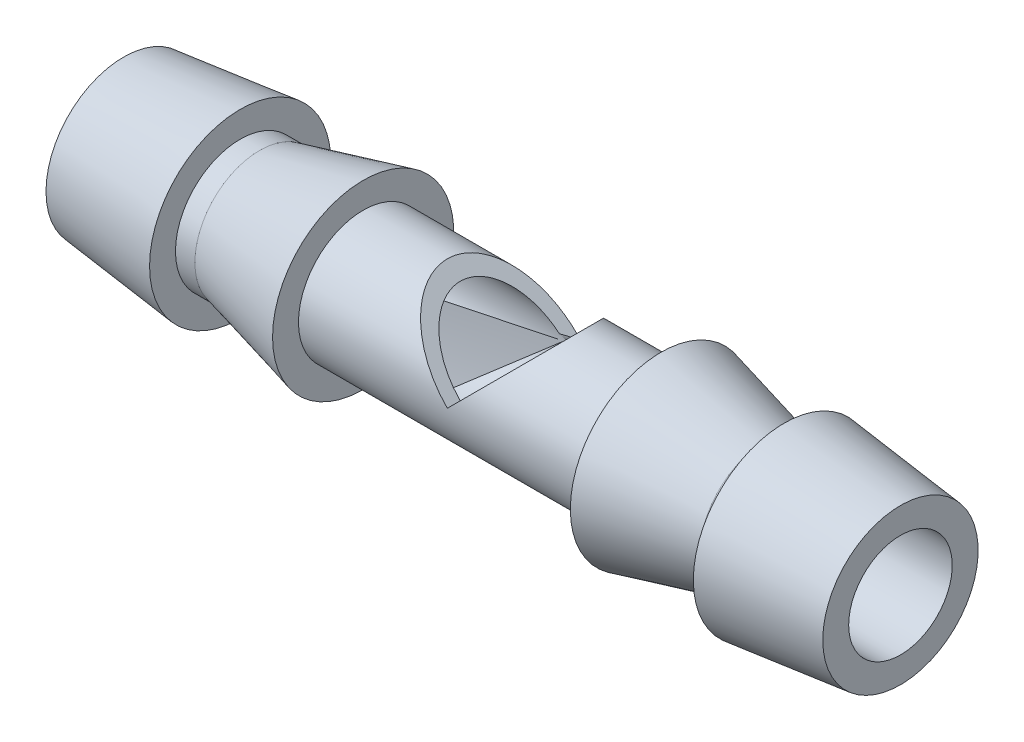
ISO-10303-21;
HEADER;
FILE_DESCRIPTION(('STEP AP214'),'2;1');
FILE_NAME('part.step','',(''),(''),'','','');
FILE_SCHEMA(('AUTOMOTIVE_DESIGN { 1 0 10303 214 1 1 1 1 }'));
ENDSEC;
DATA;
#1=APPLICATION_CONTEXT('core data for automotive mechanical design processes');
#2=APPLICATION_PROTOCOL_DEFINITION('international standard','automotive_design',2000,#1);
#3=PRODUCT_CONTEXT('',#1,'mechanical');
#4=PRODUCT('Part','Part','',(#3));
#5=PRODUCT_RELATED_PRODUCT_CATEGORY('part','',(#4));
#6=PRODUCT_DEFINITION_FORMATION('','',#4);
#7=PRODUCT_DEFINITION_CONTEXT('part definition',#1,'design');
#8=PRODUCT_DEFINITION('design','',#6,#7);
#9=PRODUCT_DEFINITION_SHAPE('','',#8);
#10=(LENGTH_UNIT() NAMED_UNIT(*) SI_UNIT(.MILLI.,.METRE.));
#11=(NAMED_UNIT(*) PLANE_ANGLE_UNIT() SI_UNIT($,.RADIAN.));
#12=(NAMED_UNIT(*) SI_UNIT($,.STERADIAN.) SOLID_ANGLE_UNIT());
#13=UNCERTAINTY_MEASURE_WITH_UNIT(LENGTH_MEASURE(1.E-05),#10,'distance_accuracy_value','');
#14=(GEOMETRIC_REPRESENTATION_CONTEXT(3) GLOBAL_UNCERTAINTY_ASSIGNED_CONTEXT((#13)) GLOBAL_UNIT_ASSIGNED_CONTEXT((#10,
#11,#12)) REPRESENTATION_CONTEXT('',''));
#15=CARTESIAN_POINT('',(0.,0.,0.));
#16=DIRECTION('',(0.,0.,1.));
#17=DIRECTION('',(1.,0.,0.));
#18=AXIS2_PLACEMENT_3D('',#15,#16,#17);
#19=CARTESIAN_POINT('',(-19.363000869984,2.,0.));
#20=DIRECTION('',(-1.,0.,0.));
#21=DIRECTION('',(0.,0.,1.));
#22=AXIS2_PLACEMENT_3D('',#19,#20,#21);
#23=PLANE('',#22);
#24=CARTESIAN_POINT('',(-19.363000869984,0.,0.));
#25=DIRECTION('',(-1.,0.,0.));
#26=DIRECTION('',(0.,0.,1.));
#27=AXIS2_PLACEMENT_3D('',#24,#25,#26);
#28=CIRCLE('',#27,3.);
#29=CARTESIAN_POINT('',(-19.363000869984,0.,3.));
#30=VERTEX_POINT('',#29);
#31=EDGE_CURVE('E89',#30,#30,#28,.T.);
#32=ORIENTED_EDGE('',*,*,#31,.F.);
#33=EDGE_LOOP('',(#32));
#34=FACE_BOUND('',#33,.T.);
#35=CARTESIAN_POINT('',(-19.363000869984,0.,0.));
#36=DIRECTION('',(-1.,0.,0.));
#37=DIRECTION('',(0.,0.,1.));
#38=AXIS2_PLACEMENT_3D('',#35,#36,#37);
#39=CIRCLE('',#38,2.);
#40=CARTESIAN_POINT('',(-19.363000869984,0.,2.));
#41=VERTEX_POINT('',#40);
#42=EDGE_CURVE('E76',#41,#41,#39,.T.);
#43=ORIENTED_EDGE('',*,*,#42,.T.);
#44=EDGE_LOOP('',(#43));
#45=FACE_BOUND('',#44,.T.);
#46=ADVANCED_FACE('F43',(#34,#45),#23,.F.);
#47=CARTESIAN_POINT('',(0.,0.,0.));
#48=DIRECTION('',(-1.,0.,0.));
#49=DIRECTION('',(0.,0.,1.));
#50=AXIS2_PLACEMENT_3D('',#47,#48,#49);
#51=CYLINDRICAL_SURFACE('',#50,2.);
#52=CARTESIAN_POINT('',(-34.363000869984,0.,0.));
#53=DIRECTION('',(-0.707106781186543,-0.707106781186552,0.));
#54=DIRECTION('',(-0.707106781186552,0.707106781186543,0.));
#55=AXIS2_PLACEMENT_3D('',#52,#53,#54);
#56=ELLIPSE('',#55,2.82842712474621,2.);
#57=CARTESIAN_POINT('',(-34.363000869984,0.,-2.));
#58=VERTEX_POINT('',#57);
#59=CARTESIAN_POINT('',(-34.363000869984,0.,2.));
#60=VERTEX_POINT('',#59);
#61=EDGE_CURVE('E79',#58,#60,#56,.F.);
#62=ORIENTED_EDGE('',*,*,#61,.T.);
#63=CARTESIAN_POINT('',(-34.363000869984,0.,0.));
#64=DIRECTION('',(0.707106781186548,-0.707106781186547,0.));
#65=DIRECTION('',(-0.707106781186547,-0.707106781186548,0.));
#66=AXIS2_PLACEMENT_3D('',#63,#64,#65);
#67=ELLIPSE('',#66,2.82842712474619,2.);
#68=EDGE_CURVE('E84',#60,#58,#67,.F.);
#69=ORIENTED_EDGE('',*,*,#68,.T.);
#70=EDGE_LOOP('',(#62,#69));
#71=FACE_BOUND('',#70,.T.);
#72=ORIENTED_EDGE('',*,*,#42,.F.);
#73=EDGE_LOOP('',(#72));
#74=FACE_BOUND('',#73,.T.);
#75=CARTESIAN_POINT('',(-49.363000869984,0.,0.));
#76=DIRECTION('',(-1.,0.,0.));
#77=DIRECTION('',(0.,0.,1.));
#78=AXIS2_PLACEMENT_3D('',#75,#76,#77);
#79=CIRCLE('',#78,2.);
#80=CARTESIAN_POINT('',(-49.363000869984,0.,2.));
#81=VERTEX_POINT('',#80);
#82=EDGE_CURVE('E137',#81,#81,#79,.T.);
#83=ORIENTED_EDGE('',*,*,#82,.T.);
#84=EDGE_LOOP('',(#83));
#85=FACE_BOUND('',#84,.T.);
#86=ADVANCED_FACE('F146',(#71,#74,#85),#51,.F.);
#87=CARTESIAN_POINT('',(-49.363000869984,2.,0.));
#88=DIRECTION('',(1.,0.,0.));
#89=DIRECTION('',(0.,0.,-1.));
#90=AXIS2_PLACEMENT_3D('',#87,#88,#89);
#91=PLANE('',#90);
#92=ORIENTED_EDGE('',*,*,#82,.F.);
#93=EDGE_LOOP('',(#92));
#94=FACE_BOUND('',#93,.T.);
#95=CARTESIAN_POINT('',(-49.363000869984,0.,0.));
#96=DIRECTION('',(-1.,0.,0.));
#97=DIRECTION('',(0.,0.,1.));
#98=AXIS2_PLACEMENT_3D('',#95,#96,#97);
#99=CIRCLE('',#98,3.);
#100=CARTESIAN_POINT('',(-49.363000869984,0.,3.));
#101=VERTEX_POINT('',#100);
#102=EDGE_CURVE('E133',#101,#101,#99,.T.);
#103=ORIENTED_EDGE('',*,*,#102,.T.);
#104=EDGE_LOOP('',(#103));
#105=FACE_BOUND('',#104,.T.);
#106=ADVANCED_FACE('F149',(#94,#105),#91,.F.);
#107=CARTESIAN_POINT('',(-44.863000869984,0.,0.));
#108=DIRECTION('',(1.,0.,0.));
#109=DIRECTION('',(0.,0.,-1.));
#110=AXIS2_PLACEMENT_3D('',#107,#108,#109);
#111=CONICAL_SURFACE('',#110,3.5,0.110657221173896);
#112=ORIENTED_EDGE('',*,*,#102,.F.);
#113=EDGE_LOOP('',(#112));
#114=FACE_BOUND('',#113,.T.);
#115=CARTESIAN_POINT('',(-44.863000869984,0.,0.));
#116=DIRECTION('',(-1.,0.,0.));
#117=DIRECTION('',(0.,0.,1.));
#118=AXIS2_PLACEMENT_3D('',#115,#116,#117);
#119=CIRCLE('',#118,3.5);
#120=CARTESIAN_POINT('',(-44.863000869984,0.,3.5));
#121=VERTEX_POINT('',#120);
#122=EDGE_CURVE('E129',#121,#121,#119,.T.);
#123=ORIENTED_EDGE('',*,*,#122,.T.);
#124=EDGE_LOOP('',(#123));
#125=FACE_BOUND('',#124,.T.);
#126=ADVANCED_FACE('F155',(#114,#125),#111,.T.);
#127=CARTESIAN_POINT('',(-44.863000869984,3.5,0.));
#128=DIRECTION('',(-1.,0.,0.));
#129=DIRECTION('',(0.,0.,1.));
#130=AXIS2_PLACEMENT_3D('',#127,#128,#129);
#131=PLANE('',#130);
#132=ORIENTED_EDGE('',*,*,#122,.F.);
#133=EDGE_LOOP('',(#132));
#134=FACE_BOUND('',#133,.T.);
#135=CARTESIAN_POINT('',(-44.863000869984,0.,0.));
#136=DIRECTION('',(-1.,0.,0.));
#137=DIRECTION('',(0.,0.,1.));
#138=AXIS2_PLACEMENT_3D('',#135,#136,#137);
#139=CIRCLE('',#138,2.5);
#140=CARTESIAN_POINT('',(-44.863000869984,0.,2.5));
#141=VERTEX_POINT('',#140);
#142=EDGE_CURVE('E125',#141,#141,#139,.T.);
#143=ORIENTED_EDGE('',*,*,#142,.T.);
#144=EDGE_LOOP('',(#143));
#145=FACE_BOUND('',#144,.T.);
#146=ADVANCED_FACE('F161',(#134,#145),#131,.F.);
#147=CARTESIAN_POINT('',(0.,0.,0.));
#148=DIRECTION('',(-1.,0.,0.));
#149=DIRECTION('',(0.,0.,1.));
#150=AXIS2_PLACEMENT_3D('',#147,#148,#149);
#151=CYLINDRICAL_SURFACE('',#150,2.5);
#152=ORIENTED_EDGE('',*,*,#142,.F.);
#153=EDGE_LOOP('',(#152));
#154=FACE_BOUND('',#153,.T.);
#155=CARTESIAN_POINT('',(-44.113000869984,0.,0.));
#156=DIRECTION('',(-1.,0.,0.));
#157=DIRECTION('',(0.,0.,1.));
#158=AXIS2_PLACEMENT_3D('',#155,#156,#157);
#159=CIRCLE('',#158,2.5);
#160=CARTESIAN_POINT('',(-44.113000869984,0.,2.5));
#161=VERTEX_POINT('',#160);
#162=EDGE_CURVE('E121',#161,#161,#159,.T.);
#163=ORIENTED_EDGE('',*,*,#162,.T.);
#164=EDGE_LOOP('',(#163));
#165=FACE_BOUND('',#164,.T.);
#166=ADVANCED_FACE('F167',(#154,#165),#151,.T.);
#167=CARTESIAN_POINT('',(-40.113000869984,0.,0.));
#168=DIRECTION('',(1.,0.,0.));
#169=DIRECTION('',(0.,0.,-1.));
#170=AXIS2_PLACEMENT_3D('',#167,#168,#169);
#171=CONICAL_SURFACE('',#170,3.5,0.244978663126864);
#172=ORIENTED_EDGE('',*,*,#162,.F.);
#173=EDGE_LOOP('',(#172));
#174=FACE_BOUND('',#173,.T.);
#175=CARTESIAN_POINT('',(-40.113000869984,0.,0.));
#176=DIRECTION('',(-1.,0.,0.));
#177=DIRECTION('',(0.,0.,1.));
#178=AXIS2_PLACEMENT_3D('',#175,#176,#177);
#179=CIRCLE('',#178,3.5);
#180=CARTESIAN_POINT('',(-40.113000869984,0.,3.5));
#181=VERTEX_POINT('',#180);
#182=EDGE_CURVE('E117',#181,#181,#179,.T.);
#183=ORIENTED_EDGE('',*,*,#182,.T.);
#184=EDGE_LOOP('',(#183));
#185=FACE_BOUND('',#184,.T.);
#186=ADVANCED_FACE('F173',(#174,#185),#171,.T.);
#187=CARTESIAN_POINT('',(-40.113000869984,3.5,0.));
#188=DIRECTION('',(-1.,0.,0.));
#189=DIRECTION('',(0.,0.,1.));
#190=AXIS2_PLACEMENT_3D('',#187,#188,#189);
#191=PLANE('',#190);
#192=ORIENTED_EDGE('',*,*,#182,.F.);
#193=EDGE_LOOP('',(#192));
#194=FACE_BOUND('',#193,.T.);
#195=CARTESIAN_POINT('',(-40.113000869984,0.,0.));
#196=DIRECTION('',(-1.,0.,0.));
#197=DIRECTION('',(0.,0.,1.));
#198=AXIS2_PLACEMENT_3D('',#195,#196,#197);
#199=CIRCLE('',#198,2.5);
#200=CARTESIAN_POINT('',(-40.113000869984,0.,2.5));
#201=VERTEX_POINT('',#200);
#202=EDGE_CURVE('E113',#201,#201,#199,.T.);
#203=ORIENTED_EDGE('',*,*,#202,.T.);
#204=EDGE_LOOP('',(#203));
#205=FACE_BOUND('',#204,.T.);
#206=ADVANCED_FACE('F179',(#194,#205),#191,.F.);
#207=CARTESIAN_POINT('',(0.,0.,0.));
#208=DIRECTION('',(-1.,0.,0.));
#209=DIRECTION('',(0.,0.,1.));
#210=AXIS2_PLACEMENT_3D('',#207,#208,#209);
#211=CYLINDRICAL_SURFACE('',#210,2.5);
#212=CARTESIAN_POINT('',(-34.363000869984,0.,0.));
#213=DIRECTION('',(-0.707106781186543,-0.707106781186552,0.));
#214=DIRECTION('',(-0.707106781186552,0.707106781186543,0.));
#215=AXIS2_PLACEMENT_3D('',#212,#213,#214);
#216=ELLIPSE('',#215,3.53553390593276,2.5);
#217=CARTESIAN_POINT('',(-34.363000869984,0.,2.5));
#218=VERTEX_POINT('',#217);
#219=CARTESIAN_POINT('',(-34.363000869984,0.,-2.5));
#220=VERTEX_POINT('',#219);
#221=EDGE_CURVE('E51',#218,#220,#216,.T.);
#222=ORIENTED_EDGE('',*,*,#221,.T.);
#223=CARTESIAN_POINT('',(-34.363000869984,0.,0.));
#224=DIRECTION('',(0.707106781186548,-0.707106781186547,0.));
#225=DIRECTION('',(-0.707106781186547,-0.707106781186548,0.));
#226=AXIS2_PLACEMENT_3D('',#223,#224,#225);
#227=ELLIPSE('',#226,3.53553390593273,2.5);
#228=EDGE_CURVE('E11',#220,#218,#227,.T.);
#229=ORIENTED_EDGE('',*,*,#228,.T.);
#230=EDGE_LOOP('',(#222,#229));
#231=FACE_BOUND('',#230,.T.);
#232=ORIENTED_EDGE('',*,*,#202,.F.);
#233=EDGE_LOOP('',(#232));
#234=FACE_BOUND('',#233,.T.);
#235=CARTESIAN_POINT('',(-28.613000869984,0.,0.));
#236=DIRECTION('',(-1.,0.,0.));
#237=DIRECTION('',(0.,0.,1.));
#238=AXIS2_PLACEMENT_3D('',#235,#236,#237);
#239=CIRCLE('',#238,2.5);
#240=CARTESIAN_POINT('',(-28.613000869984,0.,2.5));
#241=VERTEX_POINT('',#240);
#242=EDGE_CURVE('E109',#241,#241,#239,.T.);
#243=ORIENTED_EDGE('',*,*,#242,.T.);
#244=EDGE_LOOP('',(#243));
#245=FACE_BOUND('',#244,.T.);
#246=ADVANCED_FACE('F73',(#231,#234,#245),#211,.T.);
#247=CARTESIAN_POINT('',(-28.613000869984,3.5,0.));
#248=DIRECTION('',(1.,0.,0.));
#249=DIRECTION('',(0.,0.,-1.));
#250=AXIS2_PLACEMENT_3D('',#247,#248,#249);
#251=PLANE('',#250);
#252=ORIENTED_EDGE('',*,*,#242,.F.);
#253=EDGE_LOOP('',(#252));
#254=FACE_BOUND('',#253,.T.);
#255=CARTESIAN_POINT('',(-28.613000869984,0.,0.));
#256=DIRECTION('',(-1.,0.,0.));
#257=DIRECTION('',(0.,0.,1.));
#258=AXIS2_PLACEMENT_3D('',#255,#256,#257);
#259=CIRCLE('',#258,3.5);
#260=CARTESIAN_POINT('',(-28.613000869984,0.,3.5));
#261=VERTEX_POINT('',#260);
#262=EDGE_CURVE('E105',#261,#261,#259,.T.);
#263=ORIENTED_EDGE('',*,*,#262,.T.);
#264=EDGE_LOOP('',(#263));
#265=FACE_BOUND('',#264,.T.);
#266=ADVANCED_FACE('F189',(#254,#265),#251,.F.);
#267=CARTESIAN_POINT('',(-24.613000869984,0.,0.));
#268=DIRECTION('',(-1.,0.,0.));
#269=DIRECTION('',(0.,0.,1.));
#270=AXIS2_PLACEMENT_3D('',#267,#268,#269);
#271=CONICAL_SURFACE('',#270,2.5,0.244978663126865);
#272=ORIENTED_EDGE('',*,*,#262,.F.);
#273=EDGE_LOOP('',(#272));
#274=FACE_BOUND('',#273,.T.);
#275=CARTESIAN_POINT('',(-24.613000869984,0.,0.));
#276=DIRECTION('',(-1.,0.,0.));
#277=DIRECTION('',(0.,0.,1.));
#278=AXIS2_PLACEMENT_3D('',#275,#276,#277);
#279=CIRCLE('',#278,2.5);
#280=CARTESIAN_POINT('',(-24.613000869984,0.,2.5));
#281=VERTEX_POINT('',#280);
#282=EDGE_CURVE('E101',#281,#281,#279,.T.);
#283=ORIENTED_EDGE('',*,*,#282,.T.);
#284=EDGE_LOOP('',(#283));
#285=FACE_BOUND('',#284,.T.);
#286=ADVANCED_FACE('F195',(#274,#285),#271,.T.);
#287=CARTESIAN_POINT('',(0.,0.,0.));
#288=DIRECTION('',(-1.,0.,0.));
#289=DIRECTION('',(0.,0.,1.));
#290=AXIS2_PLACEMENT_3D('',#287,#288,#289);
#291=CYLINDRICAL_SURFACE('',#290,2.5);
#292=ORIENTED_EDGE('',*,*,#282,.F.);
#293=EDGE_LOOP('',(#292));
#294=FACE_BOUND('',#293,.T.);
#295=CARTESIAN_POINT('',(-23.863000869984,0.,0.));
#296=DIRECTION('',(-1.,0.,0.));
#297=DIRECTION('',(0.,0.,1.));
#298=AXIS2_PLACEMENT_3D('',#295,#296,#297);
#299=CIRCLE('',#298,2.5);
#300=CARTESIAN_POINT('',(-23.863000869984,0.,2.5));
#301=VERTEX_POINT('',#300);
#302=EDGE_CURVE('E97',#301,#301,#299,.T.);
#303=ORIENTED_EDGE('',*,*,#302,.T.);
#304=EDGE_LOOP('',(#303));
#305=FACE_BOUND('',#304,.T.);
#306=ADVANCED_FACE('F201',(#294,#305),#291,.T.);
#307=CARTESIAN_POINT('',(-23.863000869984,3.5,0.));
#308=DIRECTION('',(1.,0.,0.));
#309=DIRECTION('',(0.,0.,-1.));
#310=AXIS2_PLACEMENT_3D('',#307,#308,#309);
#311=PLANE('',#310);
#312=ORIENTED_EDGE('',*,*,#302,.F.);
#313=EDGE_LOOP('',(#312));
#314=FACE_BOUND('',#313,.T.);
#315=CARTESIAN_POINT('',(-23.863000869984,0.,0.));
#316=DIRECTION('',(-1.,0.,0.));
#317=DIRECTION('',(0.,0.,1.));
#318=AXIS2_PLACEMENT_3D('',#315,#316,#317);
#319=CIRCLE('',#318,3.5);
#320=CARTESIAN_POINT('',(-23.863000869984,0.,3.5));
#321=VERTEX_POINT('',#320);
#322=EDGE_CURVE('E93',#321,#321,#319,.T.);
#323=ORIENTED_EDGE('',*,*,#322,.T.);
#324=EDGE_LOOP('',(#323));
#325=FACE_BOUND('',#324,.T.);
#326=ADVANCED_FACE('F207',(#314,#325),#311,.F.);
#327=CARTESIAN_POINT('',(-19.363000869984,0.,0.));
#328=DIRECTION('',(-1.,0.,0.));
#329=DIRECTION('',(0.,0.,1.));
#330=AXIS2_PLACEMENT_3D('',#327,#328,#329);
#331=CONICAL_SURFACE('',#330,3.,0.110657221173895);
#332=ORIENTED_EDGE('',*,*,#322,.F.);
#333=EDGE_LOOP('',(#332));
#334=FACE_BOUND('',#333,.T.);
#335=ORIENTED_EDGE('',*,*,#31,.T.);
#336=EDGE_LOOP('',(#335));
#337=FACE_BOUND('',#336,.T.);
#338=ADVANCED_FACE('F213',(#334,#337),#331,.T.);
#339=CARTESIAN_POINT('',(-34.363000869984,0.,-3.5));
#340=DIRECTION('',(0.707106781186548,-0.707106781186547,0.));
#341=DIRECTION('',(0.707106781186547,0.707106781186548,0.));
#342=AXIS2_PLACEMENT_3D('',#339,#340,#341);
#343=PLANE('',#342);
#344=DIRECTION('',(0.,0.,1.));
#345=VECTOR('',#344,1.);
#346=CARTESIAN_POINT('',(-34.363000869984,0.,-3.5));
#347=LINE('',#346,#345);
#348=EDGE_CURVE('E58',#60,#218,#347,.T.);
#349=ORIENTED_EDGE('',*,*,#348,.T.);
#350=ORIENTED_EDGE('',*,*,#228,.F.);
#351=EDGE_CURVE('E70',#220,#58,#347,.T.);
#352=ORIENTED_EDGE('',*,*,#351,.T.);
#353=ORIENTED_EDGE('',*,*,#68,.F.);
#354=EDGE_LOOP('',(#349,#350,#352,#353));
#355=FACE_BOUND('',#354,.T.);
#356=ADVANCED_FACE('F69',(#355),#343,.F.);
#357=CARTESIAN_POINT('',(-34.363000869984,0.,-3.5));
#358=DIRECTION('',(-0.707106781186543,-0.707106781186552,0.));
#359=DIRECTION('',(0.707106781186552,-0.707106781186543,0.));
#360=AXIS2_PLACEMENT_3D('',#357,#358,#359);
#361=PLANE('',#360);
#362=ORIENTED_EDGE('',*,*,#351,.F.);
#363=ORIENTED_EDGE('',*,*,#221,.F.);
#364=ORIENTED_EDGE('',*,*,#348,.F.);
#365=ORIENTED_EDGE('',*,*,#61,.F.);
#366=EDGE_LOOP('',(#362,#363,#364,#365));
#367=FACE_BOUND('',#366,.T.);
#368=ADVANCED_FACE('F77',(#367),#361,.F.);
#369=CLOSED_SHELL('',(#46,#86,#106,#126,#146,#166,#186,#206,#246,#266,#286,#306,#326,#338,#356,#368));
#370=MANIFOLD_SOLID_BREP('B2',#369);
#371=ADVANCED_BREP_SHAPE_REPRESENTATION('',(#18,#370),#14);
#372=SHAPE_DEFINITION_REPRESENTATION(#9,#371);
ENDSEC;
END-ISO-10303-21;
